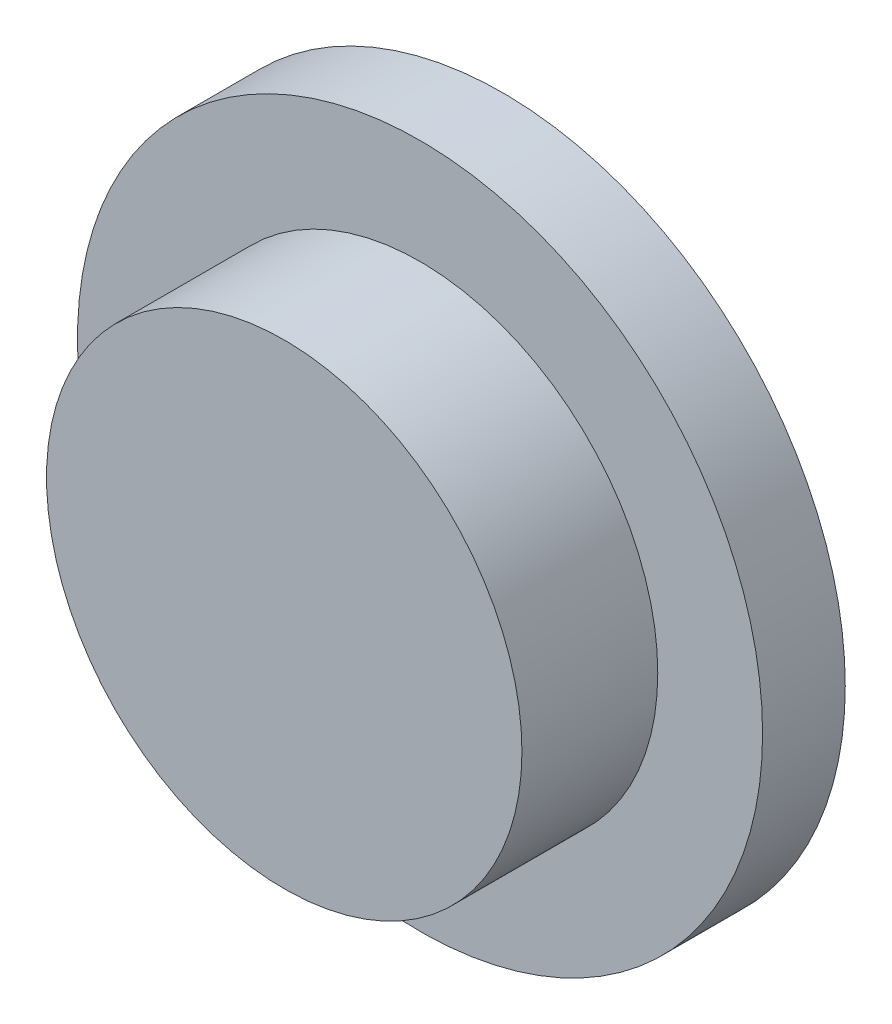
ISO-10303-21;
HEADER;
FILE_DESCRIPTION(('STEP AP214'),'2;1');
FILE_NAME('part.step','',(''),(''),'','','');
FILE_SCHEMA(('AUTOMOTIVE_DESIGN { 1 0 10303 214 1 1 1 1 }'));
ENDSEC;
DATA;
#1=APPLICATION_CONTEXT('core data for automotive mechanical design processes');
#2=APPLICATION_PROTOCOL_DEFINITION('international standard','automotive_design',2000,#1);
#3=PRODUCT_CONTEXT('',#1,'mechanical');
#4=PRODUCT('Part','Part','',(#3));
#5=PRODUCT_RELATED_PRODUCT_CATEGORY('part','',(#4));
#6=PRODUCT_DEFINITION_FORMATION('','',#4);
#7=PRODUCT_DEFINITION_CONTEXT('part definition',#1,'design');
#8=PRODUCT_DEFINITION('design','',#6,#7);
#9=PRODUCT_DEFINITION_SHAPE('','',#8);
#10=(LENGTH_UNIT() NAMED_UNIT(*) SI_UNIT(.MILLI.,.METRE.));
#11=(NAMED_UNIT(*) PLANE_ANGLE_UNIT() SI_UNIT($,.RADIAN.));
#12=(NAMED_UNIT(*) SI_UNIT($,.STERADIAN.) SOLID_ANGLE_UNIT());
#13=UNCERTAINTY_MEASURE_WITH_UNIT(LENGTH_MEASURE(1.E-05),#10,'distance_accuracy_value','');
#14=(GEOMETRIC_REPRESENTATION_CONTEXT(3) GLOBAL_UNCERTAINTY_ASSIGNED_CONTEXT((#13)) GLOBAL_UNIT_ASSIGNED_CONTEXT((#10,
#11,#12)) REPRESENTATION_CONTEXT('',''));
#15=CARTESIAN_POINT('',(0.,0.,0.));
#16=DIRECTION('',(0.,0.,1.));
#17=DIRECTION('',(1.,0.,0.));
#18=AXIS2_PLACEMENT_3D('',#15,#16,#17);
#19=CARTESIAN_POINT('',(0.,0.,14.));
#20=DIRECTION('',(0.,0.,-1.));
#21=DIRECTION('',(-1.,0.,0.));
#22=AXIS2_PLACEMENT_3D('',#19,#20,#21);
#23=CYLINDRICAL_SURFACE('',#22,58.);
#24=CARTESIAN_POINT('',(0.,0.,14.));
#25=DIRECTION('',(0.,0.,-1.));
#26=DIRECTION('',(1.,0.,0.));
#27=AXIS2_PLACEMENT_3D('',#24,#25,#26);
#28=CIRCLE('',#27,58.);
#29=CARTESIAN_POINT('',(58.,0.,14.));
#30=VERTEX_POINT('',#29);
#31=EDGE_CURVE('E10',#30,#30,#28,.T.);
#32=ORIENTED_EDGE('',*,*,#31,.T.);
#33=EDGE_LOOP('',(#32));
#34=FACE_BOUND('',#33,.T.);
#35=CARTESIAN_POINT('',(0.,0.,0.));
#36=DIRECTION('',(0.,0.,-1.));
#37=DIRECTION('',(1.,0.,0.));
#38=AXIS2_PLACEMENT_3D('',#35,#36,#37);
#39=CIRCLE('',#38,58.);
#40=CARTESIAN_POINT('',(58.,0.,0.));
#41=VERTEX_POINT('',#40);
#42=EDGE_CURVE('E18',#41,#41,#39,.T.);
#43=ORIENTED_EDGE('',*,*,#42,.F.);
#44=EDGE_LOOP('',(#43));
#45=FACE_BOUND('',#44,.T.);
#46=ADVANCED_FACE('F15',(#34,#45),#23,.T.);
#47=CARTESIAN_POINT('',(0.,0.,14.));
#48=DIRECTION('',(0.,0.,-1.));
#49=DIRECTION('',(-1.,0.,0.));
#50=AXIS2_PLACEMENT_3D('',#47,#48,#49);
#51=PLANE('',#50);
#52=CARTESIAN_POINT('',(0.,0.,14.));
#53=DIRECTION('',(0.,0.,-1.));
#54=DIRECTION('',(1.,0.,0.));
#55=AXIS2_PLACEMENT_3D('',#52,#53,#54);
#56=CIRCLE('',#55,40.25);
#57=CARTESIAN_POINT('',(40.25,0.,14.));
#58=VERTEX_POINT('',#57);
#59=EDGE_CURVE('E28',#58,#58,#56,.T.);
#60=ORIENTED_EDGE('',*,*,#59,.T.);
#61=EDGE_LOOP('',(#60));
#62=FACE_BOUND('',#61,.T.);
#63=ORIENTED_EDGE('',*,*,#31,.F.);
#64=EDGE_LOOP('',(#63));
#65=FACE_BOUND('',#64,.T.);
#66=ADVANCED_FACE('F59',(#62,#65),#51,.F.);
#67=CARTESIAN_POINT('',(0.,0.,0.));
#68=DIRECTION('',(0.,0.,-1.));
#69=DIRECTION('',(-1.,0.,0.));
#70=AXIS2_PLACEMENT_3D('',#67,#68,#69);
#71=PLANE('',#70);
#72=CARTESIAN_POINT('',(0.,0.,0.));
#73=DIRECTION('',(0.,0.,1.));
#74=DIRECTION('',(0.,1.,0.));
#75=AXIS2_PLACEMENT_3D('',#72,#73,#74);
#76=CIRCLE('',#75,17.5);
#77=CARTESIAN_POINT('',(0.,17.5,0.));
#78=VERTEX_POINT('',#77);
#79=EDGE_CURVE('E37',#78,#78,#76,.T.);
#80=ORIENTED_EDGE('',*,*,#79,.T.);
#81=EDGE_LOOP('',(#80));
#82=FACE_BOUND('',#81,.T.);
#83=ORIENTED_EDGE('',*,*,#42,.T.);
#84=EDGE_LOOP('',(#83));
#85=FACE_BOUND('',#84,.T.);
#86=ADVANCED_FACE('F41',(#82,#85),#71,.T.);
#87=CARTESIAN_POINT('',(0.,0.,37.));
#88=DIRECTION('',(0.,0.,-1.));
#89=DIRECTION('',(-1.,0.,0.));
#90=AXIS2_PLACEMENT_3D('',#87,#88,#89);
#91=CYLINDRICAL_SURFACE('',#90,40.25);
#92=CARTESIAN_POINT('',(0.,0.,37.));
#93=DIRECTION('',(0.,0.,-1.));
#94=DIRECTION('',(1.,0.,0.));
#95=AXIS2_PLACEMENT_3D('',#92,#93,#94);
#96=CIRCLE('',#95,40.25);
#97=CARTESIAN_POINT('',(40.25,0.,37.));
#98=VERTEX_POINT('',#97);
#99=EDGE_CURVE('E26',#98,#98,#96,.T.);
#100=ORIENTED_EDGE('',*,*,#99,.T.);
#101=EDGE_LOOP('',(#100));
#102=FACE_BOUND('',#101,.T.);
#103=ORIENTED_EDGE('',*,*,#59,.F.);
#104=EDGE_LOOP('',(#103));
#105=FACE_BOUND('',#104,.T.);
#106=ADVANCED_FACE('F68',(#102,#105),#91,.T.);
#107=CARTESIAN_POINT('',(0.,0.,37.));
#108=DIRECTION('',(0.,0.,-1.));
#109=DIRECTION('',(-1.,0.,0.));
#110=AXIS2_PLACEMENT_3D('',#107,#108,#109);
#111=PLANE('',#110);
#112=ORIENTED_EDGE('',*,*,#99,.F.);
#113=EDGE_LOOP('',(#112));
#114=FACE_BOUND('',#113,.T.);
#115=ADVANCED_FACE('F53',(#114),#111,.F.);
#116=CARTESIAN_POINT('',(0.,0.,20.22));
#117=DIRECTION('',(0.,0.,1.));
#118=DIRECTION('',(1.,0.,0.));
#119=AXIS2_PLACEMENT_3D('',#116,#117,#118);
#120=PLANE('',#119);
#121=CARTESIAN_POINT('',(0.,0.,20.22));
#122=DIRECTION('',(0.,0.,-1.));
#123=DIRECTION('',(0.,1.,0.));
#124=AXIS2_PLACEMENT_3D('',#121,#122,#123);
#125=CIRCLE('',#124,17.5);
#126=CARTESIAN_POINT('',(0.,17.5,20.22));
#127=VERTEX_POINT('',#126);
#128=EDGE_CURVE('E32',#127,#127,#125,.T.);
#129=ORIENTED_EDGE('',*,*,#128,.T.);
#130=EDGE_LOOP('',(#129));
#131=FACE_BOUND('',#130,.T.);
#132=ADVANCED_FACE('F46',(#131),#120,.F.);
#133=CARTESIAN_POINT('',(0.,0.,0.));
#134=DIRECTION('',(0.,0.,1.));
#135=DIRECTION('',(0.,1.,0.));
#136=AXIS2_PLACEMENT_3D('',#133,#134,#135);
#137=CYLINDRICAL_SURFACE('',#136,17.5);
#138=ORIENTED_EDGE('',*,*,#128,.F.);
#139=EDGE_LOOP('',(#138));
#140=FACE_BOUND('',#139,.T.);
#141=ORIENTED_EDGE('',*,*,#79,.F.);
#142=EDGE_LOOP('',(#141));
#143=FACE_BOUND('',#142,.T.);
#144=ADVANCED_FACE('F44',(#140,#143),#137,.F.);
#145=CLOSED_SHELL('',(#46,#66,#86,#106,#115,#132,#144));
#146=MANIFOLD_SOLID_BREP('B1',#145);
#147=ADVANCED_BREP_SHAPE_REPRESENTATION('',(#18,#146),#14);
#148=SHAPE_DEFINITION_REPRESENTATION(#9,#147);
ENDSEC;
END-ISO-10303-21;
